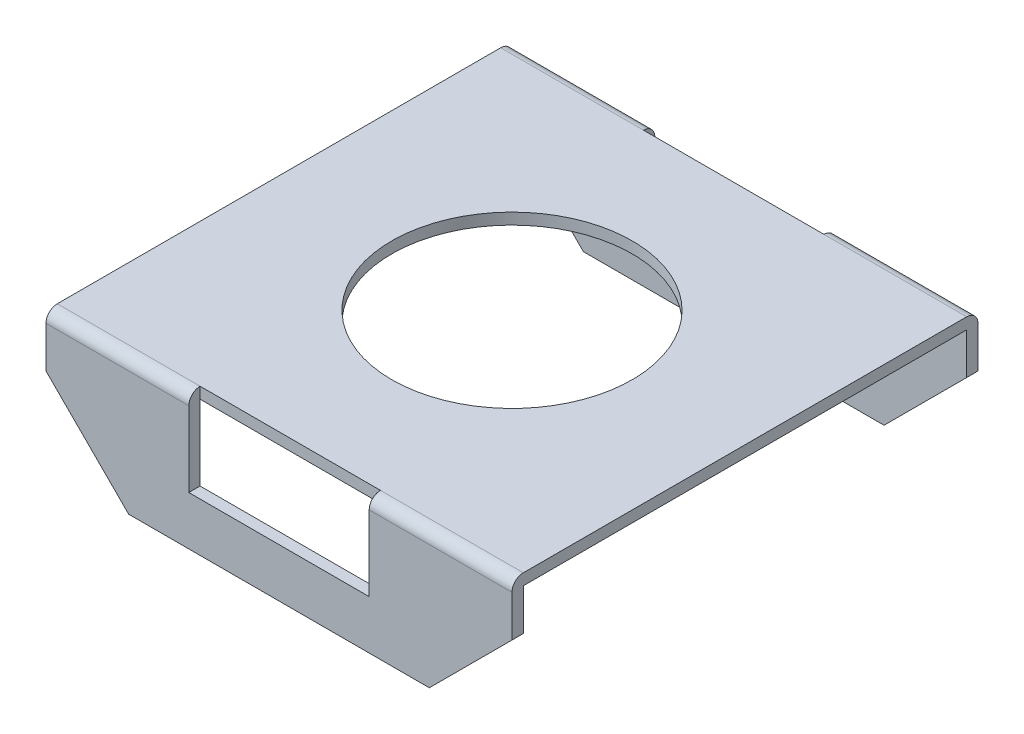
ISO-10303-21;
HEADER;
FILE_DESCRIPTION(('STEP AP214'),'2;1');
FILE_NAME('part.step','',(''),(''),'','','');
FILE_SCHEMA(('AUTOMOTIVE_DESIGN { 1 0 10303 214 1 1 1 1 }'));
ENDSEC;
DATA;
#1=APPLICATION_CONTEXT('core data for automotive mechanical design processes');
#2=APPLICATION_PROTOCOL_DEFINITION('international standard','automotive_design',2000,#1);
#3=PRODUCT_CONTEXT('',#1,'mechanical');
#4=PRODUCT('Part','Part','',(#3));
#5=PRODUCT_RELATED_PRODUCT_CATEGORY('part','',(#4));
#6=PRODUCT_DEFINITION_FORMATION('','',#4);
#7=PRODUCT_DEFINITION_CONTEXT('part definition',#1,'design');
#8=PRODUCT_DEFINITION('design','',#6,#7);
#9=PRODUCT_DEFINITION_SHAPE('','',#8);
#10=(LENGTH_UNIT() NAMED_UNIT(*) SI_UNIT(.MILLI.,.METRE.));
#11=(NAMED_UNIT(*) PLANE_ANGLE_UNIT() SI_UNIT($,.RADIAN.));
#12=(NAMED_UNIT(*) SI_UNIT($,.STERADIAN.) SOLID_ANGLE_UNIT());
#13=UNCERTAINTY_MEASURE_WITH_UNIT(LENGTH_MEASURE(1.E-05),#10,'distance_accuracy_value','');
#14=(GEOMETRIC_REPRESENTATION_CONTEXT(3) GLOBAL_UNCERTAINTY_ASSIGNED_CONTEXT((#13)) GLOBAL_UNIT_ASSIGNED_CONTEXT((#10,
#11,#12)) REPRESENTATION_CONTEXT('',''));
#15=CARTESIAN_POINT('',(0.,0.,0.));
#16=DIRECTION('',(0.,0.,1.));
#17=DIRECTION('',(1.,0.,0.));
#18=AXIS2_PLACEMENT_3D('',#15,#16,#17);
#19=CARTESIAN_POINT('',(3.1,2.,-2.95));
#20=DIRECTION('',(0.,0.,-1.));
#21=DIRECTION('',(-1.,0.,0.));
#22=AXIS2_PLACEMENT_3D('',#19,#20,#21);
#23=PLANE('',#22);
#24=DIRECTION('',(-1.,0.,0.));
#25=VECTOR('',#24,1.);
#26=CARTESIAN_POINT('',(3.1,0.2,-2.95));
#27=LINE('',#26,#25);
#28=CARTESIAN_POINT('',(2.,0.2,-2.95));
#29=VERTEX_POINT('',#28);
#30=CARTESIAN_POINT('',(-2.,0.2,-2.95));
#31=VERTEX_POINT('',#30);
#32=EDGE_CURVE('E296',#29,#31,#27,.T.);
#33=ORIENTED_EDGE('',*,*,#32,.F.);
#34=DIRECTION('',(0.707106781186551,0.707106781186544,0.));
#35=VECTOR('',#34,1.);
#36=CARTESIAN_POINT('',(3.45000000000001,1.64999999999999,-2.95));
#37=LINE('',#36,#35);
#38=CARTESIAN_POINT('',(3.1,1.29999999999999,-2.95));
#39=VERTEX_POINT('',#38);
#40=EDGE_CURVE('E377',#29,#39,#37,.T.);
#41=ORIENTED_EDGE('',*,*,#40,.T.);
#42=DIRECTION('',(0.,1.,0.));
#43=VECTOR('',#42,1.);
#44=CARTESIAN_POINT('',(3.1,2.,-2.95));
#45=LINE('',#44,#43);
#46=CARTESIAN_POINT('',(3.1,1.85,-2.95));
#47=VERTEX_POINT('',#46);
#48=EDGE_CURVE('E282',#47,#39,#45,.F.);
#49=ORIENTED_EDGE('',*,*,#48,.F.);
#50=DIRECTION('',(-1.,0.,0.));
#51=VECTOR('',#50,1.);
#52=CARTESIAN_POINT('',(3.1,1.85,-2.95));
#53=LINE('',#52,#51);
#54=CARTESIAN_POINT('',(1.2,1.85,-2.95));
#55=VERTEX_POINT('',#54);
#56=EDGE_CURVE('E283',#47,#55,#53,.T.);
#57=ORIENTED_EDGE('',*,*,#56,.T.);
#58=DIRECTION('',(0.,-1.,0.));
#59=VECTOR('',#58,1.);
#60=CARTESIAN_POINT('',(1.2,2.,-2.95));
#61=LINE('',#60,#59);
#62=CARTESIAN_POINT('',(1.2,0.85,-2.95));
#63=VERTEX_POINT('',#62);
#64=EDGE_CURVE('E327',#55,#63,#61,.T.);
#65=ORIENTED_EDGE('',*,*,#64,.T.);
#66=DIRECTION('',(-1.,0.,0.));
#67=VECTOR('',#66,1.);
#68=CARTESIAN_POINT('',(3.1,0.85,-2.95));
#69=LINE('',#68,#67);
#70=CARTESIAN_POINT('',(-1.2,0.85,-2.95));
#71=VERTEX_POINT('',#70);
#72=EDGE_CURVE('E332',#63,#71,#69,.T.);
#73=ORIENTED_EDGE('',*,*,#72,.T.);
#74=DIRECTION('',(0.,1.,0.));
#75=VECTOR('',#74,1.);
#76=CARTESIAN_POINT('',(-1.2,2.,-2.95));
#77=LINE('',#76,#75);
#78=CARTESIAN_POINT('',(-1.2,1.85,-2.95));
#79=VERTEX_POINT('',#78);
#80=EDGE_CURVE('E330',#71,#79,#77,.T.);
#81=ORIENTED_EDGE('',*,*,#80,.T.);
#82=CARTESIAN_POINT('',(-3.1,1.85,-2.95));
#83=VERTEX_POINT('',#82);
#84=EDGE_CURVE('E287',#79,#83,#53,.T.);
#85=ORIENTED_EDGE('',*,*,#84,.T.);
#86=DIRECTION('',(0.,1.,0.));
#87=VECTOR('',#86,1.);
#88=CARTESIAN_POINT('',(-3.1,2.,-2.95));
#89=LINE('',#88,#87);
#90=CARTESIAN_POINT('',(-3.1,1.29999999999999,-2.95));
#91=VERTEX_POINT('',#90);
#92=EDGE_CURVE('E335',#83,#91,#89,.F.);
#93=ORIENTED_EDGE('',*,*,#92,.T.);
#94=DIRECTION('',(0.707106781186552,-0.707106781186544,0.));
#95=VECTOR('',#94,1.);
#96=CARTESIAN_POINT('',(-0.349999999999971,-1.45000000000001,-2.95));
#97=LINE('',#96,#95);
#98=EDGE_CURVE('E365',#91,#31,#97,.T.);
#99=ORIENTED_EDGE('',*,*,#98,.T.);
#100=EDGE_LOOP('',(#33,#41,#49,#57,#65,#73,#81,#85,#93,#99));
#101=FACE_BOUND('',#100,.T.);
#102=ADVANCED_FACE('F33',(#101),#23,.F.);
#103=CARTESIAN_POINT('',(3.1,0.2,-3.1));
#104=DIRECTION('',(0.,-1.,0.));
#105=DIRECTION('',(0.,0.,-1.));
#106=AXIS2_PLACEMENT_3D('',#103,#104,#105);
#107=PLANE('',#106);
#108=DIRECTION('',(0.,0.,1.));
#109=VECTOR('',#108,1.);
#110=CARTESIAN_POINT('',(2.,0.2,-3.1));
#111=LINE('',#110,#109);
#112=CARTESIAN_POINT('',(2.,0.2,-3.1));
#113=VERTEX_POINT('',#112);
#114=EDGE_CURVE('E442',#113,#29,#111,.T.);
#115=ORIENTED_EDGE('',*,*,#114,.T.);
#116=ORIENTED_EDGE('',*,*,#32,.T.);
#117=DIRECTION('',(0.,0.,1.));
#118=VECTOR('',#117,1.);
#119=CARTESIAN_POINT('',(-2.,0.2,-3.1));
#120=LINE('',#119,#118);
#121=CARTESIAN_POINT('',(-2.,0.2,-3.1));
#122=VERTEX_POINT('',#121);
#123=EDGE_CURVE('E367',#122,#31,#120,.T.);
#124=ORIENTED_EDGE('',*,*,#123,.F.);
#125=DIRECTION('',(-1.,0.,0.));
#126=VECTOR('',#125,1.);
#127=CARTESIAN_POINT('',(3.1,0.2,-3.1));
#128=LINE('',#127,#126);
#129=EDGE_CURVE('E294',#113,#122,#128,.T.);
#130=ORIENTED_EDGE('',*,*,#129,.F.);
#131=EDGE_LOOP('',(#115,#116,#124,#130));
#132=FACE_BOUND('',#131,.T.);
#133=ADVANCED_FACE('F482',(#132),#107,.T.);
#134=CARTESIAN_POINT('',(3.1,2.,-3.1));
#135=DIRECTION('',(0.,0.,-1.));
#136=DIRECTION('',(-1.,0.,0.));
#137=AXIS2_PLACEMENT_3D('',#134,#135,#136);
#138=PLANE('',#137);
#139=DIRECTION('',(0.,-1.,0.));
#140=VECTOR('',#139,1.);
#141=CARTESIAN_POINT('',(-3.1,2.,-3.1));
#142=LINE('',#141,#140);
#143=CARTESIAN_POINT('',(-3.1,1.85,-3.1));
#144=VERTEX_POINT('',#143);
#145=CARTESIAN_POINT('',(-3.1,1.29999999999999,-3.1));
#146=VERTEX_POINT('',#145);
#147=EDGE_CURVE('E276',#144,#146,#142,.T.);
#148=ORIENTED_EDGE('',*,*,#147,.F.);
#149=DIRECTION('',(-1.,0.,0.));
#150=VECTOR('',#149,1.);
#151=CARTESIAN_POINT('',(3.1,1.85,-3.1));
#152=LINE('',#151,#150);
#153=CARTESIAN_POINT('',(-1.2,1.85,-3.1));
#154=VERTEX_POINT('',#153);
#155=EDGE_CURVE('E242',#144,#154,#152,.F.);
#156=ORIENTED_EDGE('',*,*,#155,.T.);
#157=DIRECTION('',(0.,-1.,0.));
#158=VECTOR('',#157,1.);
#159=CARTESIAN_POINT('',(-1.2,1.85,-3.1));
#160=LINE('',#159,#158);
#161=CARTESIAN_POINT('',(-1.2,0.85,-3.1));
#162=VERTEX_POINT('',#161);
#163=EDGE_CURVE('E388',#154,#162,#160,.T.);
#164=ORIENTED_EDGE('',*,*,#163,.T.);
#165=DIRECTION('',(1.,0.,0.));
#166=VECTOR('',#165,1.);
#167=CARTESIAN_POINT('',(-1.2,0.85,-3.1));
#168=LINE('',#167,#166);
#169=CARTESIAN_POINT('',(1.2,0.85,-3.1));
#170=VERTEX_POINT('',#169);
#171=EDGE_CURVE('E321',#162,#170,#168,.T.);
#172=ORIENTED_EDGE('',*,*,#171,.T.);
#173=DIRECTION('',(0.,1.,0.));
#174=VECTOR('',#173,1.);
#175=CARTESIAN_POINT('',(1.2,1.85,-3.1));
#176=LINE('',#175,#174);
#177=CARTESIAN_POINT('',(1.2,1.85,-3.1));
#178=VERTEX_POINT('',#177);
#179=EDGE_CURVE('E318',#170,#178,#176,.T.);
#180=ORIENTED_EDGE('',*,*,#179,.T.);
#181=DIRECTION('',(-1.,0.,0.));
#182=VECTOR('',#181,1.);
#183=CARTESIAN_POINT('',(3.1,1.85,-3.1));
#184=LINE('',#183,#182);
#185=CARTESIAN_POINT('',(3.1,1.85,-3.1));
#186=VERTEX_POINT('',#185);
#187=EDGE_CURVE('E240',#178,#186,#184,.F.);
#188=ORIENTED_EDGE('',*,*,#187,.T.);
#189=DIRECTION('',(0.,-1.,0.));
#190=VECTOR('',#189,1.);
#191=CARTESIAN_POINT('',(3.1,2.,-3.1));
#192=LINE('',#191,#190);
#193=CARTESIAN_POINT('',(3.1,1.29999999999999,-3.1));
#194=VERTEX_POINT('',#193);
#195=EDGE_CURVE('E338',#186,#194,#192,.T.);
#196=ORIENTED_EDGE('',*,*,#195,.T.);
#197=DIRECTION('',(-0.707106781186551,-0.707106781186544,0.));
#198=VECTOR('',#197,1.);
#199=CARTESIAN_POINT('',(3.1,1.29999999999999,-3.1));
#200=LINE('',#199,#198);
#201=EDGE_CURVE('E436',#194,#113,#200,.T.);
#202=ORIENTED_EDGE('',*,*,#201,.T.);
#203=ORIENTED_EDGE('',*,*,#129,.T.);
#204=DIRECTION('',(-0.707106781186551,0.707106781186543,0.));
#205=VECTOR('',#204,1.);
#206=CARTESIAN_POINT('',(-3.1,1.29999999999999,-3.1));
#207=LINE('',#206,#205);
#208=EDGE_CURVE('E362',#122,#146,#207,.T.);
#209=ORIENTED_EDGE('',*,*,#208,.T.);
#210=EDGE_LOOP('',(#148,#156,#164,#172,#180,#188,#196,#202,#203,#209));
#211=FACE_BOUND('',#210,.T.);
#212=ADVANCED_FACE('F369',(#211),#138,.T.);
#213=CARTESIAN_POINT('',(3.1,2.,3.1));
#214=DIRECTION('',(0.,1.,0.));
#215=DIRECTION('',(0.,0.,1.));
#216=AXIS2_PLACEMENT_3D('',#213,#214,#215);
#217=PLANE('',#216);
#218=CARTESIAN_POINT('',(0.,2.,0.));
#219=DIRECTION('',(0.,1.,0.));
#220=DIRECTION('',(0.,0.,1.));
#221=AXIS2_PLACEMENT_3D('',#218,#219,#220);
#222=CIRCLE('',#221,1.6);
#223=CARTESIAN_POINT('',(0.,2.,1.6));
#224=VERTEX_POINT('',#223);
#225=EDGE_CURVE('E710',#224,#224,#222,.T.);
#226=ORIENTED_EDGE('',*,*,#225,.F.);
#227=EDGE_LOOP('',(#226));
#228=FACE_BOUND('',#227,.T.);
#229=DIRECTION('',(1.,0.,0.));
#230=VECTOR('',#229,1.);
#231=CARTESIAN_POINT('',(-1.2,2.,-2.95));
#232=LINE('',#231,#230);
#233=CARTESIAN_POINT('',(-1.2,2.,-2.95));
#234=VERTEX_POINT('',#233);
#235=CARTESIAN_POINT('',(1.2,2.,-2.95));
#236=VERTEX_POINT('',#235);
#237=EDGE_CURVE('E426',#234,#236,#232,.T.);
#238=ORIENTED_EDGE('',*,*,#237,.F.);
#239=DIRECTION('',(-1.,0.,0.));
#240=VECTOR('',#239,1.);
#241=CARTESIAN_POINT('',(3.1,2.,-2.95));
#242=LINE('',#241,#240);
#243=CARTESIAN_POINT('',(-3.1,2.,-2.95));
#244=VERTEX_POINT('',#243);
#245=EDGE_CURVE('E233',#234,#244,#242,.T.);
#246=ORIENTED_EDGE('',*,*,#245,.T.);
#247=DIRECTION('',(0.,0.,-1.));
#248=VECTOR('',#247,1.);
#249=CARTESIAN_POINT('',(-3.1,2.,3.1));
#250=LINE('',#249,#248);
#251=CARTESIAN_POINT('',(-3.1,2.,2.95));
#252=VERTEX_POINT('',#251);
#253=EDGE_CURVE('E272',#252,#244,#250,.T.);
#254=ORIENTED_EDGE('',*,*,#253,.F.);
#255=DIRECTION('',(-1.,0.,0.));
#256=VECTOR('',#255,1.);
#257=CARTESIAN_POINT('',(3.1,2.,2.95));
#258=LINE('',#257,#256);
#259=CARTESIAN_POINT('',(-1.2,2.,2.95));
#260=VERTEX_POINT('',#259);
#261=EDGE_CURVE('E219',#252,#260,#258,.F.);
#262=ORIENTED_EDGE('',*,*,#261,.T.);
#263=DIRECTION('',(-1.,0.,0.));
#264=VECTOR('',#263,1.);
#265=CARTESIAN_POINT('',(-1.2,2.,2.95));
#266=LINE('',#265,#264);
#267=CARTESIAN_POINT('',(1.2,2.,2.95));
#268=VERTEX_POINT('',#267);
#269=EDGE_CURVE('E205',#268,#260,#266,.T.);
#270=ORIENTED_EDGE('',*,*,#269,.F.);
#271=DIRECTION('',(-1.,0.,0.));
#272=VECTOR('',#271,1.);
#273=CARTESIAN_POINT('',(3.1,2.,2.95));
#274=LINE('',#273,#272);
#275=CARTESIAN_POINT('',(3.1,2.,2.95));
#276=VERTEX_POINT('',#275);
#277=EDGE_CURVE('E215',#268,#276,#274,.F.);
#278=ORIENTED_EDGE('',*,*,#277,.T.);
#279=DIRECTION('',(0.,0.,-1.));
#280=VECTOR('',#279,1.);
#281=CARTESIAN_POINT('',(3.1,2.,3.1));
#282=LINE('',#281,#280);
#283=CARTESIAN_POINT('',(3.1,2.,-2.95));
#284=VERTEX_POINT('',#283);
#285=EDGE_CURVE('E340',#276,#284,#282,.T.);
#286=ORIENTED_EDGE('',*,*,#285,.T.);
#287=DIRECTION('',(-1.,0.,0.));
#288=VECTOR('',#287,1.);
#289=CARTESIAN_POINT('',(3.1,2.,-2.95));
#290=LINE('',#289,#288);
#291=EDGE_CURVE('E225',#284,#236,#290,.T.);
#292=ORIENTED_EDGE('',*,*,#291,.T.);
#293=EDGE_LOOP('',(#238,#246,#254,#262,#270,#278,#286,#292));
#294=FACE_BOUND('',#293,.T.);
#295=ADVANCED_FACE('F213',(#228,#294),#217,.T.);
#296=CARTESIAN_POINT('',(3.1,0.2,3.1));
#297=DIRECTION('',(0.,0.,1.));
#298=DIRECTION('',(1.,0.,0.));
#299=AXIS2_PLACEMENT_3D('',#296,#297,#298);
#300=PLANE('',#299);
#301=DIRECTION('',(0.,-1.,0.));
#302=VECTOR('',#301,1.);
#303=CARTESIAN_POINT('',(-1.2,1.85,3.1));
#304=LINE('',#303,#302);
#305=CARTESIAN_POINT('',(-1.2,1.85,3.1));
#306=VERTEX_POINT('',#305);
#307=CARTESIAN_POINT('',(-1.2,0.85,3.1));
#308=VERTEX_POINT('',#307);
#309=EDGE_CURVE('E264',#306,#308,#304,.T.);
#310=ORIENTED_EDGE('',*,*,#309,.F.);
#311=DIRECTION('',(-1.,0.,0.));
#312=VECTOR('',#311,1.);
#313=CARTESIAN_POINT('',(3.1,1.85,3.1));
#314=LINE('',#313,#312);
#315=CARTESIAN_POINT('',(-3.1,1.85,3.1));
#316=VERTEX_POINT('',#315);
#317=EDGE_CURVE('E253',#306,#316,#314,.T.);
#318=ORIENTED_EDGE('',*,*,#317,.T.);
#319=DIRECTION('',(0.,1.,0.));
#320=VECTOR('',#319,1.);
#321=CARTESIAN_POINT('',(-3.1,0.2,3.1));
#322=LINE('',#321,#320);
#323=CARTESIAN_POINT('',(-3.1,1.29999999999999,3.1));
#324=VERTEX_POINT('',#323);
#325=EDGE_CURVE('E262',#324,#316,#322,.T.);
#326=ORIENTED_EDGE('',*,*,#325,.F.);
#327=DIRECTION('',(-0.707106781186551,0.707106781186543,0.));
#328=VECTOR('',#327,1.);
#329=CARTESIAN_POINT('',(-3.1,1.29999999999999,3.1));
#330=LINE('',#329,#328);
#331=CARTESIAN_POINT('',(-2.,0.2,3.1));
#332=VERTEX_POINT('',#331);
#333=EDGE_CURVE('E373',#332,#324,#330,.T.);
#334=ORIENTED_EDGE('',*,*,#333,.F.);
#335=DIRECTION('',(-1.,0.,0.));
#336=VECTOR('',#335,1.);
#337=CARTESIAN_POINT('',(3.1,0.2,3.1));
#338=LINE('',#337,#336);
#339=CARTESIAN_POINT('',(2.,0.2,3.1));
#340=VERTEX_POINT('',#339);
#341=EDGE_CURVE('E292',#340,#332,#338,.T.);
#342=ORIENTED_EDGE('',*,*,#341,.F.);
#343=DIRECTION('',(-0.707106781186551,-0.707106781186544,0.));
#344=VECTOR('',#343,1.);
#345=CARTESIAN_POINT('',(3.1,1.29999999999999,3.1));
#346=LINE('',#345,#344);
#347=CARTESIAN_POINT('',(3.1,1.29999999999999,3.1));
#348=VERTEX_POINT('',#347);
#349=EDGE_CURVE('E406',#348,#340,#346,.T.);
#350=ORIENTED_EDGE('',*,*,#349,.F.);
#351=DIRECTION('',(0.,1.,0.));
#352=VECTOR('',#351,1.);
#353=CARTESIAN_POINT('',(3.1,0.2,3.1));
#354=LINE('',#353,#352);
#355=CARTESIAN_POINT('',(3.1,1.85,3.1));
#356=VERTEX_POINT('',#355);
#357=EDGE_CURVE('E342',#348,#356,#354,.T.);
#358=ORIENTED_EDGE('',*,*,#357,.T.);
#359=DIRECTION('',(-1.,0.,0.));
#360=VECTOR('',#359,1.);
#361=CARTESIAN_POINT('',(3.1,1.85,3.1));
#362=LINE('',#361,#360);
#363=CARTESIAN_POINT('',(1.2,1.85,3.1));
#364=VERTEX_POINT('',#363);
#365=EDGE_CURVE('E251',#356,#364,#362,.T.);
#366=ORIENTED_EDGE('',*,*,#365,.T.);
#367=DIRECTION('',(0.,1.,0.));
#368=VECTOR('',#367,1.);
#369=CARTESIAN_POINT('',(1.2,1.85,3.1));
#370=LINE('',#369,#368);
#371=CARTESIAN_POINT('',(1.2,0.85,3.1));
#372=VERTEX_POINT('',#371);
#373=EDGE_CURVE('E200',#372,#364,#370,.T.);
#374=ORIENTED_EDGE('',*,*,#373,.F.);
#375=DIRECTION('',(1.,0.,0.));
#376=VECTOR('',#375,1.);
#377=CARTESIAN_POINT('',(-1.2,0.85,3.1));
#378=LINE('',#377,#376);
#379=EDGE_CURVE('E385',#308,#372,#378,.T.);
#380=ORIENTED_EDGE('',*,*,#379,.F.);
#381=EDGE_LOOP('',(#310,#318,#326,#334,#342,#350,#358,#366,#374,#380));
#382=FACE_BOUND('',#381,.T.);
#383=ADVANCED_FACE('F260',(#382),#300,.T.);
#384=CARTESIAN_POINT('',(3.1,0.2,2.95));
#385=DIRECTION('',(0.,-1.,0.));
#386=DIRECTION('',(0.,0.,-1.));
#387=AXIS2_PLACEMENT_3D('',#384,#385,#386);
#388=PLANE('',#387);
#389=CARTESIAN_POINT('',(2.,0.2,2.95));
#390=VERTEX_POINT('',#389);
#391=EDGE_CURVE('E438',#390,#340,#111,.T.);
#392=ORIENTED_EDGE('',*,*,#391,.T.);
#393=ORIENTED_EDGE('',*,*,#341,.T.);
#394=CARTESIAN_POINT('',(-2.,0.2,2.95));
#395=VERTEX_POINT('',#394);
#396=EDGE_CURVE('E372',#395,#332,#120,.T.);
#397=ORIENTED_EDGE('',*,*,#396,.F.);
#398=DIRECTION('',(-1.,0.,0.));
#399=VECTOR('',#398,1.);
#400=CARTESIAN_POINT('',(3.1,0.2,2.95));
#401=LINE('',#400,#399);
#402=EDGE_CURVE('E290',#390,#395,#401,.T.);
#403=ORIENTED_EDGE('',*,*,#402,.F.);
#404=EDGE_LOOP('',(#392,#393,#397,#403));
#405=FACE_BOUND('',#404,.T.);
#406=ADVANCED_FACE('F469',(#405),#388,.T.);
#407=CARTESIAN_POINT('',(3.1,0.2,2.95));
#408=DIRECTION('',(0.,0.,1.));
#409=DIRECTION('',(1.,0.,0.));
#410=AXIS2_PLACEMENT_3D('',#407,#408,#409);
#411=PLANE('',#410);
#412=DIRECTION('',(0.,1.,0.));
#413=VECTOR('',#412,1.);
#414=CARTESIAN_POINT('',(3.1,0.2,2.95));
#415=LINE('',#414,#413);
#416=CARTESIAN_POINT('',(3.1,1.29999999999999,2.95));
#417=VERTEX_POINT('',#416);
#418=CARTESIAN_POINT('',(3.1,1.85,2.95));
#419=VERTEX_POINT('',#418);
#420=EDGE_CURVE('E345',#417,#419,#415,.T.);
#421=ORIENTED_EDGE('',*,*,#420,.F.);
#422=DIRECTION('',(-0.707106781186551,-0.707106781186544,0.));
#423=VECTOR('',#422,1.);
#424=CARTESIAN_POINT('',(2.55000000000001,0.75,2.95));
#425=LINE('',#424,#423);
#426=EDGE_CURVE('E441',#417,#390,#425,.T.);
#427=ORIENTED_EDGE('',*,*,#426,.T.);
#428=ORIENTED_EDGE('',*,*,#402,.T.);
#429=DIRECTION('',(-0.707106781186552,0.707106781186544,0.));
#430=VECTOR('',#429,1.);
#431=CARTESIAN_POINT('',(0.550000000000029,-2.35,2.95));
#432=LINE('',#431,#430);
#433=CARTESIAN_POINT('',(-3.1,1.29999999999999,2.95));
#434=VERTEX_POINT('',#433);
#435=EDGE_CURVE('E366',#395,#434,#432,.T.);
#436=ORIENTED_EDGE('',*,*,#435,.T.);
#437=DIRECTION('',(0.,1.,0.));
#438=VECTOR('',#437,1.);
#439=CARTESIAN_POINT('',(-3.1,0.2,2.95));
#440=LINE('',#439,#438);
#441=CARTESIAN_POINT('',(-3.1,1.85,2.95));
#442=VERTEX_POINT('',#441);
#443=EDGE_CURVE('E271',#434,#442,#440,.T.);
#444=ORIENTED_EDGE('',*,*,#443,.T.);
#445=DIRECTION('',(-1.,0.,0.));
#446=VECTOR('',#445,1.);
#447=CARTESIAN_POINT('',(3.1,1.85,2.95));
#448=LINE('',#447,#446);
#449=CARTESIAN_POINT('',(-1.2,1.85,2.95));
#450=VERTEX_POINT('',#449);
#451=EDGE_CURVE('E286',#450,#442,#448,.T.);
#452=ORIENTED_EDGE('',*,*,#451,.F.);
#453=DIRECTION('',(0.,-1.,0.));
#454=VECTOR('',#453,1.);
#455=CARTESIAN_POINT('',(-1.2,0.200000000000001,2.95));
#456=LINE('',#455,#454);
#457=CARTESIAN_POINT('',(-1.2,0.85,2.95));
#458=VERTEX_POINT('',#457);
#459=EDGE_CURVE('E308',#450,#458,#456,.T.);
#460=ORIENTED_EDGE('',*,*,#459,.T.);
#461=DIRECTION('',(1.,0.,0.));
#462=VECTOR('',#461,1.);
#463=CARTESIAN_POINT('',(3.1,0.85,2.95));
#464=LINE('',#463,#462);
#465=CARTESIAN_POINT('',(1.2,0.85,2.95));
#466=VERTEX_POINT('',#465);
#467=EDGE_CURVE('E298',#458,#466,#464,.T.);
#468=ORIENTED_EDGE('',*,*,#467,.T.);
#469=DIRECTION('',(0.,1.,0.));
#470=VECTOR('',#469,1.);
#471=CARTESIAN_POINT('',(1.2,0.200000000000001,2.95));
#472=LINE('',#471,#470);
#473=CARTESIAN_POINT('',(1.2,1.85,2.95));
#474=VERTEX_POINT('',#473);
#475=EDGE_CURVE('E305',#466,#474,#472,.T.);
#476=ORIENTED_EDGE('',*,*,#475,.T.);
#477=EDGE_CURVE('E288',#419,#474,#448,.T.);
#478=ORIENTED_EDGE('',*,*,#477,.F.);
#479=EDGE_LOOP('',(#421,#427,#428,#436,#444,#452,#460,#468,#476,#478));
#480=FACE_BOUND('',#479,.T.);
#481=ADVANCED_FACE('F303',(#480),#411,.F.);
#482=CARTESIAN_POINT('',(3.1,1.85,3.1));
#483=DIRECTION('',(0.,1.,0.));
#484=DIRECTION('',(0.,0.,1.));
#485=AXIS2_PLACEMENT_3D('',#482,#483,#484);
#486=PLANE('',#485);
#487=CARTESIAN_POINT('',(0.,1.85,0.));
#488=DIRECTION('',(0.,1.,0.));
#489=DIRECTION('',(0.,0.,1.));
#490=AXIS2_PLACEMENT_3D('',#487,#488,#489);
#491=CIRCLE('',#490,1.6);
#492=CARTESIAN_POINT('',(0.,1.85,1.6));
#493=VERTEX_POINT('',#492);
#494=EDGE_CURVE('E37',#493,#493,#491,.T.);
#495=ORIENTED_EDGE('',*,*,#494,.T.);
#496=EDGE_LOOP('',(#495));
#497=FACE_BOUND('',#496,.T.);
#498=ORIENTED_EDGE('',*,*,#477,.T.);
#499=DIRECTION('',(-1.,0.,0.));
#500=VECTOR('',#499,1.);
#501=CARTESIAN_POINT('',(3.1,1.85,2.95));
#502=LINE('',#501,#500);
#503=EDGE_CURVE('E207',#474,#450,#502,.T.);
#504=ORIENTED_EDGE('',*,*,#503,.T.);
#505=ORIENTED_EDGE('',*,*,#451,.T.);
#506=DIRECTION('',(0.,0.,-1.));
#507=VECTOR('',#506,1.);
#508=CARTESIAN_POINT('',(-3.1,1.85,3.1));
#509=LINE('',#508,#507);
#510=EDGE_CURVE('E274',#442,#83,#509,.T.);
#511=ORIENTED_EDGE('',*,*,#510,.T.);
#512=ORIENTED_EDGE('',*,*,#84,.F.);
#513=DIRECTION('',(1.,0.,0.));
#514=VECTOR('',#513,1.);
#515=CARTESIAN_POINT('',(3.1,1.85,-2.95));
#516=LINE('',#515,#514);
#517=EDGE_CURVE('E422',#79,#55,#516,.T.);
#518=ORIENTED_EDGE('',*,*,#517,.T.);
#519=ORIENTED_EDGE('',*,*,#56,.F.);
#520=DIRECTION('',(0.,0.,-1.));
#521=VECTOR('',#520,1.);
#522=CARTESIAN_POINT('',(3.1,1.85,3.1));
#523=LINE('',#522,#521);
#524=EDGE_CURVE('E347',#419,#47,#523,.T.);
#525=ORIENTED_EDGE('',*,*,#524,.F.);
#526=EDGE_LOOP('',(#498,#504,#505,#511,#512,#518,#519,#525));
#527=FACE_BOUND('',#526,.T.);
#528=ADVANCED_FACE('F455',(#497,#527),#486,.F.);
#529=CARTESIAN_POINT('',(3.1,0.,0.));
#530=DIRECTION('',(1.,0.,0.));
#531=DIRECTION('',(0.,0.,-1.));
#532=AXIS2_PLACEMENT_3D('',#529,#530,#531);
#533=PLANE('',#532);
#534=ORIENTED_EDGE('',*,*,#195,.F.);
#535=CARTESIAN_POINT('',(3.1,1.85,-2.95));
#536=DIRECTION('',(1.,0.,0.));
#537=DIRECTION('',(0.,0.,-1.));
#538=AXIS2_PLACEMENT_3D('',#535,#536,#537);
#539=CIRCLE('',#538,0.15);
#540=EDGE_CURVE('E249',#186,#284,#539,.T.);
#541=ORIENTED_EDGE('',*,*,#540,.T.);
#542=ORIENTED_EDGE('',*,*,#285,.F.);
#543=CARTESIAN_POINT('',(3.1,1.85,2.95));
#544=DIRECTION('',(1.,0.,0.));
#545=DIRECTION('',(0.,0.,-1.));
#546=AXIS2_PLACEMENT_3D('',#543,#544,#545);
#547=CIRCLE('',#546,0.15);
#548=EDGE_CURVE('E222',#276,#356,#547,.T.);
#549=ORIENTED_EDGE('',*,*,#548,.T.);
#550=ORIENTED_EDGE('',*,*,#357,.F.);
#551=DIRECTION('',(0.,0.,1.));
#552=VECTOR('',#551,1.);
#553=CARTESIAN_POINT('',(3.1,1.29999999999999,0.));
#554=LINE('',#553,#552);
#555=EDGE_CURVE('E223',#417,#348,#554,.T.);
#556=ORIENTED_EDGE('',*,*,#555,.F.);
#557=ORIENTED_EDGE('',*,*,#420,.T.);
#558=ORIENTED_EDGE('',*,*,#524,.T.);
#559=ORIENTED_EDGE('',*,*,#48,.T.);
#560=DIRECTION('',(0.,0.,1.));
#561=VECTOR('',#560,1.);
#562=CARTESIAN_POINT('',(3.1,1.29999999999999,-3.1));
#563=LINE('',#562,#561);
#564=EDGE_CURVE('E439',#194,#39,#563,.T.);
#565=ORIENTED_EDGE('',*,*,#564,.F.);
#566=EDGE_LOOP('',(#534,#541,#542,#549,#550,#556,#557,#558,#559,#565));
#567=FACE_BOUND('',#566,.T.);
#568=ADVANCED_FACE('F410',(#567),#533,.T.);
#569=CARTESIAN_POINT('',(-3.1,0.,0.));
#570=DIRECTION('',(1.,0.,0.));
#571=DIRECTION('',(0.,0.,-1.));
#572=AXIS2_PLACEMENT_3D('',#569,#570,#571);
#573=PLANE('',#572);
#574=ORIENTED_EDGE('',*,*,#253,.T.);
#575=CARTESIAN_POINT('',(-3.1,1.85,-2.95));
#576=DIRECTION('',(1.,0.,0.));
#577=DIRECTION('',(0.,0.,-1.));
#578=AXIS2_PLACEMENT_3D('',#575,#576,#577);
#579=CIRCLE('',#578,0.15);
#580=EDGE_CURVE('E238',#244,#144,#579,.F.);
#581=ORIENTED_EDGE('',*,*,#580,.T.);
#582=ORIENTED_EDGE('',*,*,#147,.T.);
#583=DIRECTION('',(0.,0.,1.));
#584=VECTOR('',#583,1.);
#585=CARTESIAN_POINT('',(-3.1,1.29999999999999,-3.1));
#586=LINE('',#585,#584);
#587=EDGE_CURVE('E354',#146,#91,#586,.T.);
#588=ORIENTED_EDGE('',*,*,#587,.T.);
#589=ORIENTED_EDGE('',*,*,#92,.F.);
#590=ORIENTED_EDGE('',*,*,#510,.F.);
#591=ORIENTED_EDGE('',*,*,#443,.F.);
#592=DIRECTION('',(0.,0.,1.));
#593=VECTOR('',#592,1.);
#594=CARTESIAN_POINT('',(-3.1,1.29999999999999,0.));
#595=LINE('',#594,#593);
#596=EDGE_CURVE('E227',#434,#324,#595,.T.);
#597=ORIENTED_EDGE('',*,*,#596,.T.);
#598=ORIENTED_EDGE('',*,*,#325,.T.);
#599=CARTESIAN_POINT('',(-3.1,1.85,2.95));
#600=DIRECTION('',(1.,0.,0.));
#601=DIRECTION('',(0.,0.,-1.));
#602=AXIS2_PLACEMENT_3D('',#599,#600,#601);
#603=CIRCLE('',#602,0.15);
#604=EDGE_CURVE('E236',#316,#252,#603,.F.);
#605=ORIENTED_EDGE('',*,*,#604,.T.);
#606=EDGE_LOOP('',(#574,#581,#582,#588,#589,#590,#591,#597,#598,#605));
#607=FACE_BOUND('',#606,.T.);
#608=ADVANCED_FACE('F269',(#607),#573,.F.);
#609=CARTESIAN_POINT('',(-1.2,0.85,-3.1));
#610=DIRECTION('',(0.,-1.,0.));
#611=DIRECTION('',(0.,0.,-1.));
#612=AXIS2_PLACEMENT_3D('',#609,#610,#611);
#613=PLANE('',#612);
#614=DIRECTION('',(0.,0.,1.));
#615=VECTOR('',#614,1.);
#616=CARTESIAN_POINT('',(-1.2,0.85,-3.1));
#617=LINE('',#616,#615);
#618=EDGE_CURVE('E314',#458,#308,#617,.T.);
#619=ORIENTED_EDGE('',*,*,#618,.T.);
#620=ORIENTED_EDGE('',*,*,#379,.T.);
#621=DIRECTION('',(0.,0.,1.));
#622=VECTOR('',#621,1.);
#623=CARTESIAN_POINT('',(1.2,0.85,-3.1));
#624=LINE('',#623,#622);
#625=EDGE_CURVE('E315',#466,#372,#624,.T.);
#626=ORIENTED_EDGE('',*,*,#625,.F.);
#627=ORIENTED_EDGE('',*,*,#467,.F.);
#628=EDGE_LOOP('',(#619,#620,#626,#627));
#629=FACE_BOUND('',#628,.T.);
#630=ADVANCED_FACE('F312',(#629),#613,.F.);
#631=CARTESIAN_POINT('',(1.2,1.85,-3.1));
#632=DIRECTION('',(1.,0.,0.));
#633=DIRECTION('',(0.,1.,0.));
#634=AXIS2_PLACEMENT_3D('',#631,#632,#633);
#635=PLANE('',#634);
#636=ORIENTED_EDGE('',*,*,#373,.T.);
#637=CARTESIAN_POINT('',(1.2,1.85,2.95));
#638=DIRECTION('',(1.,0.,0.));
#639=DIRECTION('',(0.,1.,0.));
#640=AXIS2_PLACEMENT_3D('',#637,#638,#639);
#641=CIRCLE('',#640,0.15);
#642=EDGE_CURVE('E11',#364,#268,#641,.F.);
#643=ORIENTED_EDGE('',*,*,#642,.T.);
#644=DIRECTION('',(0.,1.,0.));
#645=VECTOR('',#644,1.);
#646=CARTESIAN_POINT('',(1.2,1.,2.95));
#647=LINE('',#646,#645);
#648=EDGE_CURVE('E197',#474,#268,#647,.T.);
#649=ORIENTED_EDGE('',*,*,#648,.F.);
#650=ORIENTED_EDGE('',*,*,#475,.F.);
#651=ORIENTED_EDGE('',*,*,#625,.T.);
#652=EDGE_LOOP('',(#636,#643,#649,#650,#651));
#653=FACE_BOUND('',#652,.T.);
#654=ADVANCED_FACE('F195',(#653),#635,.F.);
#655=CARTESIAN_POINT('',(-1.2,1.85,-3.1));
#656=DIRECTION('',(-1.,0.,0.));
#657=DIRECTION('',(0.,-1.,0.));
#658=AXIS2_PLACEMENT_3D('',#655,#656,#657);
#659=PLANE('',#658);
#660=DIRECTION('',(0.,1.,0.));
#661=VECTOR('',#660,1.);
#662=CARTESIAN_POINT('',(-1.2,1.,2.95));
#663=LINE('',#662,#661);
#664=EDGE_CURVE('E209',#450,#260,#663,.T.);
#665=ORIENTED_EDGE('',*,*,#664,.T.);
#666=CARTESIAN_POINT('',(-1.2,1.85,2.95));
#667=DIRECTION('',(-1.,0.,0.));
#668=DIRECTION('',(0.,-1.,0.));
#669=AXIS2_PLACEMENT_3D('',#666,#667,#668);
#670=CIRCLE('',#669,0.15);
#671=EDGE_CURVE('E42',#260,#306,#670,.F.);
#672=ORIENTED_EDGE('',*,*,#671,.T.);
#673=ORIENTED_EDGE('',*,*,#309,.T.);
#674=ORIENTED_EDGE('',*,*,#618,.F.);
#675=ORIENTED_EDGE('',*,*,#459,.F.);
#676=EDGE_LOOP('',(#665,#672,#673,#674,#675));
#677=FACE_BOUND('',#676,.T.);
#678=ADVANCED_FACE('F316',(#677),#659,.F.);
#679=EDGE_CURVE('E325',#170,#63,#624,.T.);
#680=ORIENTED_EDGE('',*,*,#679,.F.);
#681=ORIENTED_EDGE('',*,*,#171,.F.);
#682=EDGE_CURVE('E317',#162,#71,#617,.T.);
#683=ORIENTED_EDGE('',*,*,#682,.T.);
#684=ORIENTED_EDGE('',*,*,#72,.F.);
#685=EDGE_LOOP('',(#680,#681,#683,#684));
#686=FACE_BOUND('',#685,.T.);
#687=ADVANCED_FACE('F397',(#686),#613,.F.);
#688=ORIENTED_EDGE('',*,*,#163,.F.);
#689=CARTESIAN_POINT('',(-1.2,1.85,-2.95));
#690=DIRECTION('',(-1.,0.,0.));
#691=DIRECTION('',(0.,-1.,0.));
#692=AXIS2_PLACEMENT_3D('',#689,#690,#691);
#693=CIRCLE('',#692,0.15);
#694=EDGE_CURVE('E244',#154,#234,#693,.F.);
#695=ORIENTED_EDGE('',*,*,#694,.T.);
#696=DIRECTION('',(0.,1.,0.));
#697=VECTOR('',#696,1.);
#698=CARTESIAN_POINT('',(-1.2,1.,-2.95));
#699=LINE('',#698,#697);
#700=EDGE_CURVE('E423',#79,#234,#699,.T.);
#701=ORIENTED_EDGE('',*,*,#700,.F.);
#702=ORIENTED_EDGE('',*,*,#80,.F.);
#703=ORIENTED_EDGE('',*,*,#682,.F.);
#704=EDGE_LOOP('',(#688,#695,#701,#702,#703));
#705=FACE_BOUND('',#704,.T.);
#706=ADVANCED_FACE('F458',(#705),#659,.F.);
#707=DIRECTION('',(0.,1.,0.));
#708=VECTOR('',#707,1.);
#709=CARTESIAN_POINT('',(1.2,1.,-2.95));
#710=LINE('',#709,#708);
#711=EDGE_CURVE('E417',#55,#236,#710,.T.);
#712=ORIENTED_EDGE('',*,*,#711,.T.);
#713=CARTESIAN_POINT('',(1.2,1.85,-2.95));
#714=DIRECTION('',(1.,0.,0.));
#715=DIRECTION('',(0.,1.,0.));
#716=AXIS2_PLACEMENT_3D('',#713,#714,#715);
#717=CIRCLE('',#716,0.15);
#718=EDGE_CURVE('E246',#236,#178,#717,.F.);
#719=ORIENTED_EDGE('',*,*,#718,.T.);
#720=ORIENTED_EDGE('',*,*,#179,.F.);
#721=ORIENTED_EDGE('',*,*,#679,.T.);
#722=ORIENTED_EDGE('',*,*,#64,.F.);
#723=EDGE_LOOP('',(#712,#719,#720,#721,#722));
#724=FACE_BOUND('',#723,.T.);
#725=ADVANCED_FACE('F416',(#724),#635,.F.);
#726=CARTESIAN_POINT('',(-3.1,1.29999999999999,-3.1));
#727=DIRECTION('',(0.707106781186544,0.707106781186552,0.));
#728=DIRECTION('',(-0.707106781186552,0.707106781186544,0.));
#729=AXIS2_PLACEMENT_3D('',#726,#727,#728);
#730=PLANE('',#729);
#731=ORIENTED_EDGE('',*,*,#396,.T.);
#732=ORIENTED_EDGE('',*,*,#333,.T.);
#733=ORIENTED_EDGE('',*,*,#596,.F.);
#734=ORIENTED_EDGE('',*,*,#435,.F.);
#735=EDGE_LOOP('',(#731,#732,#733,#734));
#736=FACE_BOUND('',#735,.T.);
#737=ADVANCED_FACE('F466',(#736),#730,.F.);
#738=ORIENTED_EDGE('',*,*,#587,.F.);
#739=ORIENTED_EDGE('',*,*,#208,.F.);
#740=ORIENTED_EDGE('',*,*,#123,.T.);
#741=ORIENTED_EDGE('',*,*,#98,.F.);
#742=EDGE_LOOP('',(#738,#739,#740,#741));
#743=FACE_BOUND('',#742,.T.);
#744=ADVANCED_FACE('F360',(#743),#730,.F.);
#745=CARTESIAN_POINT('',(3.1,1.29999999999999,-3.1));
#746=DIRECTION('',(-0.707106781186544,0.707106781186551,0.));
#747=DIRECTION('',(-0.707106781186551,-0.707106781186544,0.));
#748=AXIS2_PLACEMENT_3D('',#745,#746,#747);
#749=PLANE('',#748);
#750=ORIENTED_EDGE('',*,*,#555,.T.);
#751=ORIENTED_EDGE('',*,*,#349,.T.);
#752=ORIENTED_EDGE('',*,*,#391,.F.);
#753=ORIENTED_EDGE('',*,*,#426,.F.);
#754=EDGE_LOOP('',(#750,#751,#752,#753));
#755=FACE_BOUND('',#754,.T.);
#756=ADVANCED_FACE('F471',(#755),#749,.F.);
#757=ORIENTED_EDGE('',*,*,#114,.F.);
#758=ORIENTED_EDGE('',*,*,#201,.F.);
#759=ORIENTED_EDGE('',*,*,#564,.T.);
#760=ORIENTED_EDGE('',*,*,#40,.F.);
#761=EDGE_LOOP('',(#757,#758,#759,#760));
#762=FACE_BOUND('',#761,.T.);
#763=ADVANCED_FACE('F473',(#762),#749,.F.);
#764=CARTESIAN_POINT('',(-1.2,1.,-2.95));
#765=DIRECTION('',(0.,0.,1.));
#766=DIRECTION('',(1.,0.,0.));
#767=AXIS2_PLACEMENT_3D('',#764,#765,#766);
#768=PLANE('',#767);
#769=ORIENTED_EDGE('',*,*,#700,.T.);
#770=ORIENTED_EDGE('',*,*,#237,.T.);
#771=ORIENTED_EDGE('',*,*,#711,.F.);
#772=ORIENTED_EDGE('',*,*,#517,.F.);
#773=EDGE_LOOP('',(#769,#770,#771,#772));
#774=FACE_BOUND('',#773,.T.);
#775=ADVANCED_FACE('F427',(#774),#768,.F.);
#776=CARTESIAN_POINT('',(-1.2,1.,2.95));
#777=DIRECTION('',(0.,0.,-1.));
#778=DIRECTION('',(-1.,0.,0.));
#779=AXIS2_PLACEMENT_3D('',#776,#777,#778);
#780=PLANE('',#779);
#781=ORIENTED_EDGE('',*,*,#648,.T.);
#782=ORIENTED_EDGE('',*,*,#269,.T.);
#783=ORIENTED_EDGE('',*,*,#664,.F.);
#784=ORIENTED_EDGE('',*,*,#503,.F.);
#785=EDGE_LOOP('',(#781,#782,#783,#784));
#786=FACE_BOUND('',#785,.T.);
#787=ADVANCED_FACE('F204',(#786),#780,.F.);
#788=CARTESIAN_POINT('',(3.1,1.85,-2.95));
#789=DIRECTION('',(-1.,0.,0.));
#790=DIRECTION('',(0.,0.,1.));
#791=AXIS2_PLACEMENT_3D('',#788,#789,#790);
#792=CYLINDRICAL_SURFACE('',#791,0.15);
#793=ORIENTED_EDGE('',*,*,#694,.F.);
#794=ORIENTED_EDGE('',*,*,#155,.F.);
#795=ORIENTED_EDGE('',*,*,#580,.F.);
#796=ORIENTED_EDGE('',*,*,#245,.F.);
#797=EDGE_LOOP('',(#793,#794,#795,#796));
#798=FACE_BOUND('',#797,.T.);
#799=ADVANCED_FACE('F491',(#798),#792,.T.);
#800=CARTESIAN_POINT('',(3.1,1.85,-2.95));
#801=DIRECTION('',(-1.,0.,0.));
#802=DIRECTION('',(0.,0.,1.));
#803=AXIS2_PLACEMENT_3D('',#800,#801,#802);
#804=CYLINDRICAL_SURFACE('',#803,0.15);
#805=ORIENTED_EDGE('',*,*,#540,.F.);
#806=ORIENTED_EDGE('',*,*,#187,.F.);
#807=ORIENTED_EDGE('',*,*,#718,.F.);
#808=ORIENTED_EDGE('',*,*,#291,.F.);
#809=EDGE_LOOP('',(#805,#806,#807,#808));
#810=FACE_BOUND('',#809,.T.);
#811=ADVANCED_FACE('F415',(#810),#804,.T.);
#812=CARTESIAN_POINT('',(3.1,1.85,2.95));
#813=DIRECTION('',(-1.,0.,0.));
#814=DIRECTION('',(0.,0.,1.));
#815=AXIS2_PLACEMENT_3D('',#812,#813,#814);
#816=CYLINDRICAL_SURFACE('',#815,0.15);
#817=ORIENTED_EDGE('',*,*,#671,.F.);
#818=ORIENTED_EDGE('',*,*,#261,.F.);
#819=ORIENTED_EDGE('',*,*,#604,.F.);
#820=ORIENTED_EDGE('',*,*,#317,.F.);
#821=EDGE_LOOP('',(#817,#818,#819,#820));
#822=FACE_BOUND('',#821,.T.);
#823=ADVANCED_FACE('F496',(#822),#816,.T.);
#824=CARTESIAN_POINT('',(3.1,1.85,2.95));
#825=DIRECTION('',(-1.,0.,0.));
#826=DIRECTION('',(0.,0.,1.));
#827=AXIS2_PLACEMENT_3D('',#824,#825,#826);
#828=CYLINDRICAL_SURFACE('',#827,0.15);
#829=ORIENTED_EDGE('',*,*,#548,.F.);
#830=ORIENTED_EDGE('',*,*,#277,.F.);
#831=ORIENTED_EDGE('',*,*,#642,.F.);
#832=ORIENTED_EDGE('',*,*,#365,.F.);
#833=EDGE_LOOP('',(#829,#830,#831,#832));
#834=FACE_BOUND('',#833,.T.);
#835=ADVANCED_FACE('F35',(#834),#828,.T.);
#836=CARTESIAN_POINT('',(0.,1.,0.));
#837=DIRECTION('',(0.,1.,0.));
#838=DIRECTION('',(0.,0.,1.));
#839=AXIS2_PLACEMENT_3D('',#836,#837,#838);
#840=CYLINDRICAL_SURFACE('',#839,1.6);
#841=ORIENTED_EDGE('',*,*,#225,.T.);
#842=EDGE_LOOP('',(#841));
#843=FACE_BOUND('',#842,.T.);
#844=ORIENTED_EDGE('',*,*,#494,.F.);
#845=EDGE_LOOP('',(#844));
#846=FACE_BOUND('',#845,.T.);
#847=ADVANCED_FACE('F501',(#843,#846),#840,.F.);
#848=CLOSED_SHELL('',(#102,#133,#212,#295,#383,#406,#481,#528,#568,#608,#630,#654,#678,#687,
#706,#725,#737,#744,#756,#763,#775,#787,#799,#811,#823,#835,#847));
#849=MANIFOLD_SOLID_BREP('B2',#848);
#850=ADVANCED_BREP_SHAPE_REPRESENTATION('',(#18,#849),#14);
#851=SHAPE_DEFINITION_REPRESENTATION(#9,#850);
ENDSEC;
END-ISO-10303-21;
